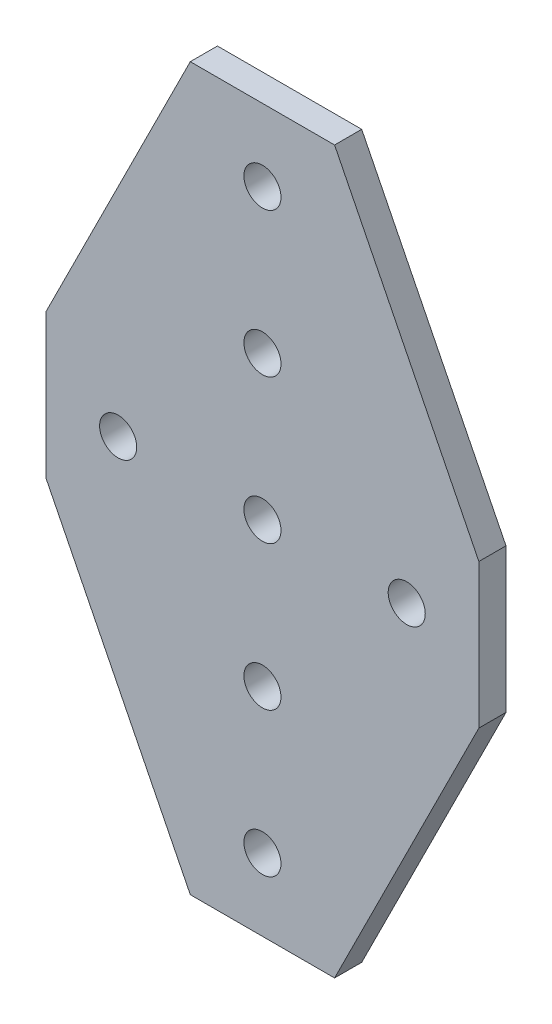
ISO-10303-21;
HEADER;
FILE_DESCRIPTION(('STEP AP214'),'2;1');
FILE_NAME('part.step','',(''),(''),'','','');
FILE_SCHEMA(('AUTOMOTIVE_DESIGN { 1 0 10303 214 1 1 1 1 }'));
ENDSEC;
DATA;
#1=APPLICATION_CONTEXT('core data for automotive mechanical design processes');
#2=APPLICATION_PROTOCOL_DEFINITION('international standard','automotive_design',2000,#1);
#3=PRODUCT_CONTEXT('',#1,'mechanical');
#4=PRODUCT('Part','Part','',(#3));
#5=PRODUCT_RELATED_PRODUCT_CATEGORY('part','',(#4));
#6=PRODUCT_DEFINITION_FORMATION('','',#4);
#7=PRODUCT_DEFINITION_CONTEXT('part definition',#1,'design');
#8=PRODUCT_DEFINITION('design','',#6,#7);
#9=PRODUCT_DEFINITION_SHAPE('','',#8);
#10=(LENGTH_UNIT() NAMED_UNIT(*) SI_UNIT(.MILLI.,.METRE.));
#11=(NAMED_UNIT(*) PLANE_ANGLE_UNIT() SI_UNIT($,.RADIAN.));
#12=(NAMED_UNIT(*) SI_UNIT($,.STERADIAN.) SOLID_ANGLE_UNIT());
#13=UNCERTAINTY_MEASURE_WITH_UNIT(LENGTH_MEASURE(1.E-05),#10,'distance_accuracy_value','');
#14=(GEOMETRIC_REPRESENTATION_CONTEXT(3) GLOBAL_UNCERTAINTY_ASSIGNED_CONTEXT((#13)) GLOBAL_UNIT_ASSIGNED_CONTEXT((#10,
#11,#12)) REPRESENTATION_CONTEXT('',''));
#15=CARTESIAN_POINT('',(0.,0.,0.));
#16=DIRECTION('',(0.,0.,1.));
#17=DIRECTION('',(1.,0.,0.));
#18=AXIS2_PLACEMENT_3D('',#15,#16,#17);
#19=CARTESIAN_POINT('',(-38.1,12.7,-2.3876));
#20=DIRECTION('',(-0.894427190999916,0.447213595499958,0.));
#21=DIRECTION('',(-0.447213595499958,-0.894427190999916,0.));
#22=AXIS2_PLACEMENT_3D('',#19,#20,#21);
#23=PLANE('',#22);
#24=DIRECTION('',(0.,0.,1.));
#25=VECTOR('',#24,1.);
#26=CARTESIAN_POINT('',(-38.1,12.7,-2.3876));
#27=LINE('',#26,#25);
#28=CARTESIAN_POINT('',(-38.1,12.7,-2.3876));
#29=VERTEX_POINT('',#28);
#30=CARTESIAN_POINT('',(-38.1,12.7,2.3876));
#31=VERTEX_POINT('',#30);
#32=EDGE_CURVE('E105',#29,#31,#27,.T.);
#33=ORIENTED_EDGE('',*,*,#32,.T.);
#34=DIRECTION('',(-0.447213595499958,-0.894427190999916,0.));
#35=VECTOR('',#34,1.);
#36=CARTESIAN_POINT('',(-38.1,12.7,2.3876));
#37=LINE('',#36,#35);
#38=CARTESIAN_POINT('',(-12.7,63.5,2.3876));
#39=VERTEX_POINT('',#38);
#40=EDGE_CURVE('E108',#39,#31,#37,.T.);
#41=ORIENTED_EDGE('',*,*,#40,.F.);
#42=DIRECTION('',(0.,0.,1.));
#43=VECTOR('',#42,1.);
#44=CARTESIAN_POINT('',(-12.7,63.5,-2.3876));
#45=LINE('',#44,#43);
#46=CARTESIAN_POINT('',(-12.7,63.5,-2.3876));
#47=VERTEX_POINT('',#46);
#48=EDGE_CURVE('E11',#47,#39,#45,.T.);
#49=ORIENTED_EDGE('',*,*,#48,.F.);
#50=DIRECTION('',(-0.447213595499958,-0.894427190999916,0.));
#51=VECTOR('',#50,1.);
#52=CARTESIAN_POINT('',(-38.1,12.7,-2.3876));
#53=LINE('',#52,#51);
#54=EDGE_CURVE('E109',#47,#29,#53,.T.);
#55=ORIENTED_EDGE('',*,*,#54,.T.);
#56=EDGE_LOOP('',(#33,#41,#49,#55));
#57=FACE_BOUND('',#56,.T.);
#58=ADVANCED_FACE('F43',(#57),#23,.T.);
#59=CARTESIAN_POINT('',(-12.7,63.5,-2.3876));
#60=DIRECTION('',(0.,1.,0.));
#61=DIRECTION('',(-1.,0.,0.));
#62=AXIS2_PLACEMENT_3D('',#59,#60,#61);
#63=PLANE('',#62);
#64=ORIENTED_EDGE('',*,*,#48,.T.);
#65=DIRECTION('',(-1.,0.,0.));
#66=VECTOR('',#65,1.);
#67=CARTESIAN_POINT('',(-12.7,63.5,2.3876));
#68=LINE('',#67,#66);
#69=CARTESIAN_POINT('',(12.7,63.5,2.3876));
#70=VERTEX_POINT('',#69);
#71=EDGE_CURVE('E127',#70,#39,#68,.T.);
#72=ORIENTED_EDGE('',*,*,#71,.F.);
#73=DIRECTION('',(0.,0.,1.));
#74=VECTOR('',#73,1.);
#75=CARTESIAN_POINT('',(12.7,63.5,-2.3876));
#76=LINE('',#75,#74);
#77=CARTESIAN_POINT('',(12.7,63.5,-2.3876));
#78=VERTEX_POINT('',#77);
#79=EDGE_CURVE('E51',#78,#70,#76,.T.);
#80=ORIENTED_EDGE('',*,*,#79,.F.);
#81=DIRECTION('',(-1.,0.,0.));
#82=VECTOR('',#81,1.);
#83=CARTESIAN_POINT('',(-12.7,63.5,-2.3876));
#84=LINE('',#83,#82);
#85=EDGE_CURVE('E114',#78,#47,#84,.T.);
#86=ORIENTED_EDGE('',*,*,#85,.T.);
#87=EDGE_LOOP('',(#64,#72,#80,#86));
#88=FACE_BOUND('',#87,.T.);
#89=ADVANCED_FACE('F208',(#88),#63,.T.);
#90=CARTESIAN_POINT('',(12.7,63.5,-2.3876));
#91=DIRECTION('',(0.894427190999916,0.447213595499958,0.));
#92=DIRECTION('',(-0.447213595499958,0.894427190999916,0.));
#93=AXIS2_PLACEMENT_3D('',#90,#91,#92);
#94=PLANE('',#93);
#95=ORIENTED_EDGE('',*,*,#79,.T.);
#96=DIRECTION('',(-0.447213595499958,0.894427190999916,0.));
#97=VECTOR('',#96,1.);
#98=CARTESIAN_POINT('',(12.7,63.5,2.3876));
#99=LINE('',#98,#97);
#100=CARTESIAN_POINT('',(38.1,12.7,2.3876));
#101=VERTEX_POINT('',#100);
#102=EDGE_CURVE('E145',#101,#70,#99,.T.);
#103=ORIENTED_EDGE('',*,*,#102,.F.);
#104=DIRECTION('',(0.,0.,1.));
#105=VECTOR('',#104,1.);
#106=CARTESIAN_POINT('',(38.1,12.7,-2.3876));
#107=LINE('',#106,#105);
#108=CARTESIAN_POINT('',(38.1,12.7,-2.3876));
#109=VERTEX_POINT('',#108);
#110=EDGE_CURVE('E167',#109,#101,#107,.T.);
#111=ORIENTED_EDGE('',*,*,#110,.F.);
#112=DIRECTION('',(-0.447213595499958,0.894427190999916,0.));
#113=VECTOR('',#112,1.);
#114=CARTESIAN_POINT('',(12.7,63.5,-2.3876));
#115=LINE('',#114,#113);
#116=EDGE_CURVE('E163',#109,#78,#115,.T.);
#117=ORIENTED_EDGE('',*,*,#116,.T.);
#118=EDGE_LOOP('',(#95,#103,#111,#117));
#119=FACE_BOUND('',#118,.T.);
#120=ADVANCED_FACE('F212',(#119),#94,.T.);
#121=CARTESIAN_POINT('',(38.1,12.7,-2.3876));
#122=DIRECTION('',(1.,0.,0.));
#123=DIRECTION('',(0.,1.,0.));
#124=AXIS2_PLACEMENT_3D('',#121,#122,#123);
#125=PLANE('',#124);
#126=ORIENTED_EDGE('',*,*,#110,.T.);
#127=DIRECTION('',(0.,1.,0.));
#128=VECTOR('',#127,1.);
#129=CARTESIAN_POINT('',(38.1,12.7,2.3876));
#130=LINE('',#129,#128);
#131=CARTESIAN_POINT('',(38.1,-12.7,2.3876));
#132=VERTEX_POINT('',#131);
#133=EDGE_CURVE('E142',#132,#101,#130,.T.);
#134=ORIENTED_EDGE('',*,*,#133,.F.);
#135=DIRECTION('',(0.,0.,1.));
#136=VECTOR('',#135,1.);
#137=CARTESIAN_POINT('',(38.1,-12.7,-2.3876));
#138=LINE('',#137,#136);
#139=CARTESIAN_POINT('',(38.1,-12.7,-2.3876));
#140=VERTEX_POINT('',#139);
#141=EDGE_CURVE('E169',#140,#132,#138,.T.);
#142=ORIENTED_EDGE('',*,*,#141,.F.);
#143=DIRECTION('',(0.,1.,0.));
#144=VECTOR('',#143,1.);
#145=CARTESIAN_POINT('',(38.1,12.7,-2.3876));
#146=LINE('',#145,#144);
#147=EDGE_CURVE('E160',#140,#109,#146,.T.);
#148=ORIENTED_EDGE('',*,*,#147,.T.);
#149=EDGE_LOOP('',(#126,#134,#142,#148));
#150=FACE_BOUND('',#149,.T.);
#151=ADVANCED_FACE('F217',(#150),#125,.T.);
#152=CARTESIAN_POINT('',(38.1,-12.7,-2.3876));
#153=DIRECTION('',(0.894427190999916,-0.447213595499958,0.));
#154=DIRECTION('',(0.447213595499958,0.894427190999916,0.));
#155=AXIS2_PLACEMENT_3D('',#152,#153,#154);
#156=PLANE('',#155);
#157=ORIENTED_EDGE('',*,*,#141,.T.);
#158=DIRECTION('',(0.447213595499958,0.894427190999916,0.));
#159=VECTOR('',#158,1.);
#160=CARTESIAN_POINT('',(38.1,-12.7,2.3876));
#161=LINE('',#160,#159);
#162=CARTESIAN_POINT('',(12.7,-63.5,2.3876));
#163=VERTEX_POINT('',#162);
#164=EDGE_CURVE('E139',#163,#132,#161,.T.);
#165=ORIENTED_EDGE('',*,*,#164,.F.);
#166=DIRECTION('',(0.,0.,1.));
#167=VECTOR('',#166,1.);
#168=CARTESIAN_POINT('',(12.7,-63.5,-2.3876));
#169=LINE('',#168,#167);
#170=CARTESIAN_POINT('',(12.7,-63.5,-2.3876));
#171=VERTEX_POINT('',#170);
#172=EDGE_CURVE('E171',#171,#163,#169,.T.);
#173=ORIENTED_EDGE('',*,*,#172,.F.);
#174=DIRECTION('',(0.447213595499958,0.894427190999916,0.));
#175=VECTOR('',#174,1.);
#176=CARTESIAN_POINT('',(38.1,-12.7,-2.3876));
#177=LINE('',#176,#175);
#178=EDGE_CURVE('E157',#171,#140,#177,.T.);
#179=ORIENTED_EDGE('',*,*,#178,.T.);
#180=EDGE_LOOP('',(#157,#165,#173,#179));
#181=FACE_BOUND('',#180,.T.);
#182=ADVANCED_FACE('F226',(#181),#156,.T.);
#183=CARTESIAN_POINT('',(12.7,-63.5,-2.3876));
#184=DIRECTION('',(0.,-1.,0.));
#185=DIRECTION('',(0.,0.,-1.));
#186=AXIS2_PLACEMENT_3D('',#183,#184,#185);
#187=PLANE('',#186);
#188=ORIENTED_EDGE('',*,*,#172,.T.);
#189=DIRECTION('',(1.,0.,0.));
#190=VECTOR('',#189,1.);
#191=CARTESIAN_POINT('',(12.7,-63.5,2.3876));
#192=LINE('',#191,#190);
#193=CARTESIAN_POINT('',(-12.7,-63.5,2.3876));
#194=VERTEX_POINT('',#193);
#195=EDGE_CURVE('E136',#194,#163,#192,.T.);
#196=ORIENTED_EDGE('',*,*,#195,.F.);
#197=DIRECTION('',(0.,0.,1.));
#198=VECTOR('',#197,1.);
#199=CARTESIAN_POINT('',(-12.7,-63.5,-2.3876));
#200=LINE('',#199,#198);
#201=CARTESIAN_POINT('',(-12.7,-63.5,-2.3876));
#202=VERTEX_POINT('',#201);
#203=EDGE_CURVE('E173',#202,#194,#200,.T.);
#204=ORIENTED_EDGE('',*,*,#203,.F.);
#205=DIRECTION('',(1.,0.,0.));
#206=VECTOR('',#205,1.);
#207=CARTESIAN_POINT('',(12.7,-63.5,-2.3876));
#208=LINE('',#207,#206);
#209=EDGE_CURVE('E154',#202,#171,#208,.T.);
#210=ORIENTED_EDGE('',*,*,#209,.T.);
#211=EDGE_LOOP('',(#188,#196,#204,#210));
#212=FACE_BOUND('',#211,.T.);
#213=ADVANCED_FACE('F230',(#212),#187,.T.);
#214=CARTESIAN_POINT('',(-12.7,-63.5,-2.3876));
#215=DIRECTION('',(-0.894427190999916,-0.447213595499958,0.));
#216=DIRECTION('',(0.447213595499958,-0.894427190999916,0.));
#217=AXIS2_PLACEMENT_3D('',#214,#215,#216);
#218=PLANE('',#217);
#219=ORIENTED_EDGE('',*,*,#203,.T.);
#220=DIRECTION('',(0.447213595499958,-0.894427190999916,0.));
#221=VECTOR('',#220,1.);
#222=CARTESIAN_POINT('',(-12.7,-63.5,2.3876));
#223=LINE('',#222,#221);
#224=CARTESIAN_POINT('',(-38.1,-12.7,2.3876));
#225=VERTEX_POINT('',#224);
#226=EDGE_CURVE('E122',#225,#194,#223,.T.);
#227=ORIENTED_EDGE('',*,*,#226,.F.);
#228=DIRECTION('',(0.,0.,1.));
#229=VECTOR('',#228,1.);
#230=CARTESIAN_POINT('',(-38.1,-12.7,-2.3876));
#231=LINE('',#230,#229);
#232=CARTESIAN_POINT('',(-38.1,-12.7,-2.3876));
#233=VERTEX_POINT('',#232);
#234=EDGE_CURVE('E113',#233,#225,#231,.T.);
#235=ORIENTED_EDGE('',*,*,#234,.F.);
#236=DIRECTION('',(0.447213595499958,-0.894427190999916,0.));
#237=VECTOR('',#236,1.);
#238=CARTESIAN_POINT('',(-12.7,-63.5,-2.3876));
#239=LINE('',#238,#237);
#240=EDGE_CURVE('E151',#233,#202,#239,.T.);
#241=ORIENTED_EDGE('',*,*,#240,.T.);
#242=EDGE_LOOP('',(#219,#227,#235,#241));
#243=FACE_BOUND('',#242,.T.);
#244=ADVANCED_FACE('F234',(#243),#218,.T.);
#245=CARTESIAN_POINT('',(-38.1,-12.7,-2.3876));
#246=DIRECTION('',(-1.,0.,0.));
#247=DIRECTION('',(0.,0.,1.));
#248=AXIS2_PLACEMENT_3D('',#245,#246,#247);
#249=PLANE('',#248);
#250=ORIENTED_EDGE('',*,*,#234,.T.);
#251=DIRECTION('',(0.,-1.,0.));
#252=VECTOR('',#251,1.);
#253=CARTESIAN_POINT('',(-38.1,-12.7,2.3876));
#254=LINE('',#253,#252);
#255=EDGE_CURVE('E117',#31,#225,#254,.T.);
#256=ORIENTED_EDGE('',*,*,#255,.F.);
#257=ORIENTED_EDGE('',*,*,#32,.F.);
#258=DIRECTION('',(0.,-1.,0.));
#259=VECTOR('',#258,1.);
#260=CARTESIAN_POINT('',(-38.1,-12.7,-2.3876));
#261=LINE('',#260,#259);
#262=EDGE_CURVE('E149',#29,#233,#261,.T.);
#263=ORIENTED_EDGE('',*,*,#262,.T.);
#264=EDGE_LOOP('',(#250,#256,#257,#263));
#265=FACE_BOUND('',#264,.T.);
#266=ADVANCED_FACE('F118',(#265),#249,.T.);
#267=CARTESIAN_POINT('',(0.,0.,-2.3876));
#268=DIRECTION('',(0.,0.,-1.));
#269=DIRECTION('',(-1.,0.,0.));
#270=AXIS2_PLACEMENT_3D('',#267,#268,#269);
#271=PLANE('',#270);
#272=CARTESIAN_POINT('',(25.4,0.,-2.3876));
#273=DIRECTION('',(0.,0.,1.));
#274=DIRECTION('',(1.,0.,0.));
#275=AXIS2_PLACEMENT_3D('',#272,#273,#274);
#276=CIRCLE('',#275,3.2639);
#277=CARTESIAN_POINT('',(28.6639,0.,-2.3876));
#278=VERTEX_POINT('',#277);
#279=EDGE_CURVE('E252',#278,#278,#276,.T.);
#280=ORIENTED_EDGE('',*,*,#279,.T.);
#281=EDGE_LOOP('',(#280));
#282=FACE_BOUND('',#281,.T.);
#283=CARTESIAN_POINT('',(-25.4,0.,-2.3876));
#284=DIRECTION('',(0.,0.,1.));
#285=DIRECTION('',(-1.,0.,0.));
#286=AXIS2_PLACEMENT_3D('',#283,#284,#285);
#287=CIRCLE('',#286,3.2639);
#288=CARTESIAN_POINT('',(-28.6639,0.,-2.3876));
#289=VERTEX_POINT('',#288);
#290=EDGE_CURVE('E256',#289,#289,#287,.T.);
#291=ORIENTED_EDGE('',*,*,#290,.T.);
#292=EDGE_LOOP('',(#291));
#293=FACE_BOUND('',#292,.T.);
#294=CARTESIAN_POINT('',(0.,50.8,-2.3876));
#295=DIRECTION('',(0.,0.,1.));
#296=DIRECTION('',(1.,0.,0.));
#297=AXIS2_PLACEMENT_3D('',#294,#295,#296);
#298=CIRCLE('',#297,3.2639);
#299=CARTESIAN_POINT('',(3.2639,50.8,-2.3876));
#300=VERTEX_POINT('',#299);
#301=EDGE_CURVE('E180',#300,#300,#298,.T.);
#302=ORIENTED_EDGE('',*,*,#301,.T.);
#303=EDGE_LOOP('',(#302));
#304=FACE_BOUND('',#303,.T.);
#305=CARTESIAN_POINT('',(2.66050878019847E-13,25.4,-2.3876));
#306=DIRECTION('',(0.,0.,1.));
#307=DIRECTION('',(1.,0.,0.));
#308=AXIS2_PLACEMENT_3D('',#305,#306,#307);
#309=CIRCLE('',#308,3.2639);
#310=CARTESIAN_POINT('',(3.26390000000027,25.4,-2.3876));
#311=VERTEX_POINT('',#310);
#312=EDGE_CURVE('E262',#311,#311,#309,.T.);
#313=ORIENTED_EDGE('',*,*,#312,.T.);
#314=EDGE_LOOP('',(#313));
#315=FACE_BOUND('',#314,.T.);
#316=CARTESIAN_POINT('',(5.32101756039693E-13,0.,-2.3876));
#317=DIRECTION('',(0.,0.,1.));
#318=DIRECTION('',(1.,0.,0.));
#319=AXIS2_PLACEMENT_3D('',#316,#317,#318);
#320=CIRCLE('',#319,3.2639);
#321=CARTESIAN_POINT('',(3.26390000000053,0.,-2.3876));
#322=VERTEX_POINT('',#321);
#323=EDGE_CURVE('E266',#322,#322,#320,.T.);
#324=ORIENTED_EDGE('',*,*,#323,.T.);
#325=EDGE_LOOP('',(#324));
#326=FACE_BOUND('',#325,.T.);
#327=CARTESIAN_POINT('',(7.9815263405954E-13,-25.4,-2.3876));
#328=DIRECTION('',(0.,0.,1.));
#329=DIRECTION('',(1.,0.,0.));
#330=AXIS2_PLACEMENT_3D('',#327,#328,#329);
#331=CIRCLE('',#330,3.2639);
#332=CARTESIAN_POINT('',(3.2639000000008,-25.4,-2.3876));
#333=VERTEX_POINT('',#332);
#334=EDGE_CURVE('E270',#333,#333,#331,.T.);
#335=ORIENTED_EDGE('',*,*,#334,.T.);
#336=EDGE_LOOP('',(#335));
#337=FACE_BOUND('',#336,.T.);
#338=CARTESIAN_POINT('',(1.06420351207939E-12,-50.8,-2.3876));
#339=DIRECTION('',(0.,0.,1.));
#340=DIRECTION('',(1.,0.,0.));
#341=AXIS2_PLACEMENT_3D('',#338,#339,#340);
#342=CIRCLE('',#341,3.2639);
#343=CARTESIAN_POINT('',(3.26390000000107,-50.8,-2.3876));
#344=VERTEX_POINT('',#343);
#345=EDGE_CURVE('E132',#344,#344,#342,.T.);
#346=ORIENTED_EDGE('',*,*,#345,.T.);
#347=EDGE_LOOP('',(#346));
#348=FACE_BOUND('',#347,.T.);
#349=ORIENTED_EDGE('',*,*,#54,.F.);
#350=ORIENTED_EDGE('',*,*,#85,.F.);
#351=ORIENTED_EDGE('',*,*,#116,.F.);
#352=ORIENTED_EDGE('',*,*,#147,.F.);
#353=ORIENTED_EDGE('',*,*,#178,.F.);
#354=ORIENTED_EDGE('',*,*,#209,.F.);
#355=ORIENTED_EDGE('',*,*,#240,.F.);
#356=ORIENTED_EDGE('',*,*,#262,.F.);
#357=EDGE_LOOP('',(#349,#350,#351,#352,#353,#354,#355,#356));
#358=FACE_BOUND('',#357,.T.);
#359=ADVANCED_FACE('F221',(#282,#293,#304,#315,#326,#337,#348,#358),#271,.T.);
#360=CARTESIAN_POINT('',(0.,0.,2.3876));
#361=DIRECTION('',(0.,0.,-1.));
#362=DIRECTION('',(-1.,0.,0.));
#363=AXIS2_PLACEMENT_3D('',#360,#361,#362);
#364=PLANE('',#363);
#365=CARTESIAN_POINT('',(25.4,0.,2.3876));
#366=DIRECTION('',(0.,0.,1.));
#367=DIRECTION('',(1.,0.,0.));
#368=AXIS2_PLACEMENT_3D('',#365,#366,#367);
#369=CIRCLE('',#368,3.2639);
#370=CARTESIAN_POINT('',(28.6639,0.,2.3876));
#371=VERTEX_POINT('',#370);
#372=EDGE_CURVE('E285',#371,#371,#369,.T.);
#373=ORIENTED_EDGE('',*,*,#372,.F.);
#374=EDGE_LOOP('',(#373));
#375=FACE_BOUND('',#374,.T.);
#376=CARTESIAN_POINT('',(-25.4,0.,2.3876));
#377=DIRECTION('',(0.,0.,1.));
#378=DIRECTION('',(-1.,0.,0.));
#379=AXIS2_PLACEMENT_3D('',#376,#377,#378);
#380=CIRCLE('',#379,3.2639);
#381=CARTESIAN_POINT('',(-28.6639,0.,2.3876));
#382=VERTEX_POINT('',#381);
#383=EDGE_CURVE('E291',#382,#382,#380,.T.);
#384=ORIENTED_EDGE('',*,*,#383,.F.);
#385=EDGE_LOOP('',(#384));
#386=FACE_BOUND('',#385,.T.);
#387=CARTESIAN_POINT('',(0.,50.8,2.3876));
#388=DIRECTION('',(0.,0.,-1.));
#389=DIRECTION('',(-1.,0.,0.));
#390=AXIS2_PLACEMENT_3D('',#387,#388,#389);
#391=CIRCLE('',#390,3.2639);
#392=CARTESIAN_POINT('',(-3.2639,50.8,2.3876));
#393=VERTEX_POINT('',#392);
#394=EDGE_CURVE('E46',#393,#393,#391,.T.);
#395=ORIENTED_EDGE('',*,*,#394,.T.);
#396=EDGE_LOOP('',(#395));
#397=FACE_BOUND('',#396,.T.);
#398=CARTESIAN_POINT('',(2.66050878019847E-13,25.4,2.3876));
#399=DIRECTION('',(0.,0.,-1.));
#400=DIRECTION('',(-1.,0.,0.));
#401=AXIS2_PLACEMENT_3D('',#398,#399,#400);
#402=CIRCLE('',#401,3.2639);
#403=CARTESIAN_POINT('',(-3.26389999999974,25.4,2.3876));
#404=VERTEX_POINT('',#403);
#405=EDGE_CURVE('E130',#404,#404,#402,.T.);
#406=ORIENTED_EDGE('',*,*,#405,.T.);
#407=EDGE_LOOP('',(#406));
#408=FACE_BOUND('',#407,.T.);
#409=CARTESIAN_POINT('',(5.32101756039693E-13,0.,2.3876));
#410=DIRECTION('',(0.,0.,-1.));
#411=DIRECTION('',(-1.,0.,0.));
#412=AXIS2_PLACEMENT_3D('',#409,#410,#411);
#413=CIRCLE('',#412,3.2639);
#414=CARTESIAN_POINT('',(-3.26389999999947,0.,2.3876));
#415=VERTEX_POINT('',#414);
#416=EDGE_CURVE('E183',#415,#415,#413,.T.);
#417=ORIENTED_EDGE('',*,*,#416,.T.);
#418=EDGE_LOOP('',(#417));
#419=FACE_BOUND('',#418,.T.);
#420=CARTESIAN_POINT('',(7.9815263405954E-13,-25.4,2.3876));
#421=DIRECTION('',(0.,0.,-1.));
#422=DIRECTION('',(-1.,0.,0.));
#423=AXIS2_PLACEMENT_3D('',#420,#421,#422);
#424=CIRCLE('',#423,3.2639);
#425=CARTESIAN_POINT('',(-3.2638999999992,-25.4,2.3876));
#426=VERTEX_POINT('',#425);
#427=EDGE_CURVE('E179',#426,#426,#424,.T.);
#428=ORIENTED_EDGE('',*,*,#427,.T.);
#429=EDGE_LOOP('',(#428));
#430=FACE_BOUND('',#429,.T.);
#431=CARTESIAN_POINT('',(1.06420351207939E-12,-50.8,2.3876));
#432=DIRECTION('',(0.,0.,-1.));
#433=DIRECTION('',(-1.,0.,0.));
#434=AXIS2_PLACEMENT_3D('',#431,#432,#433);
#435=CIRCLE('',#434,3.2639);
#436=CARTESIAN_POINT('',(-3.26389999999894,-50.8,2.3876));
#437=VERTEX_POINT('',#436);
#438=EDGE_CURVE('E176',#437,#437,#435,.T.);
#439=ORIENTED_EDGE('',*,*,#438,.T.);
#440=EDGE_LOOP('',(#439));
#441=FACE_BOUND('',#440,.T.);
#442=ORIENTED_EDGE('',*,*,#40,.T.);
#443=ORIENTED_EDGE('',*,*,#255,.T.);
#444=ORIENTED_EDGE('',*,*,#226,.T.);
#445=ORIENTED_EDGE('',*,*,#195,.T.);
#446=ORIENTED_EDGE('',*,*,#164,.T.);
#447=ORIENTED_EDGE('',*,*,#133,.T.);
#448=ORIENTED_EDGE('',*,*,#102,.T.);
#449=ORIENTED_EDGE('',*,*,#71,.T.);
#450=EDGE_LOOP('',(#442,#443,#444,#445,#446,#447,#448,#449));
#451=FACE_BOUND('',#450,.T.);
#452=ADVANCED_FACE('F125',(#375,#386,#397,#408,#419,#430,#441,#451),#364,.F.);
#453=CARTESIAN_POINT('',(1.06420351207939E-12,-50.8,-2.3876));
#454=DIRECTION('',(0.,0.,1.));
#455=DIRECTION('',(1.,0.,0.));
#456=AXIS2_PLACEMENT_3D('',#453,#454,#455);
#457=CYLINDRICAL_SURFACE('',#456,3.2639);
#458=ORIENTED_EDGE('',*,*,#345,.F.);
#459=EDGE_LOOP('',(#458));
#460=FACE_BOUND('',#459,.T.);
#461=ORIENTED_EDGE('',*,*,#438,.F.);
#462=EDGE_LOOP('',(#461));
#463=FACE_BOUND('',#462,.T.);
#464=ADVANCED_FACE('F247',(#460,#463),#457,.F.);
#465=CARTESIAN_POINT('',(7.9815263405954E-13,-25.4,-2.3876));
#466=DIRECTION('',(0.,0.,1.));
#467=DIRECTION('',(1.,0.,0.));
#468=AXIS2_PLACEMENT_3D('',#465,#466,#467);
#469=CYLINDRICAL_SURFACE('',#468,3.2639);
#470=ORIENTED_EDGE('',*,*,#334,.F.);
#471=EDGE_LOOP('',(#470));
#472=FACE_BOUND('',#471,.T.);
#473=ORIENTED_EDGE('',*,*,#427,.F.);
#474=EDGE_LOOP('',(#473));
#475=FACE_BOUND('',#474,.T.);
#476=ADVANCED_FACE('F203',(#472,#475),#469,.F.);
#477=CARTESIAN_POINT('',(5.32101756039693E-13,0.,-2.3876));
#478=DIRECTION('',(0.,0.,1.));
#479=DIRECTION('',(1.,0.,0.));
#480=AXIS2_PLACEMENT_3D('',#477,#478,#479);
#481=CYLINDRICAL_SURFACE('',#480,3.2639);
#482=ORIENTED_EDGE('',*,*,#323,.F.);
#483=EDGE_LOOP('',(#482));
#484=FACE_BOUND('',#483,.T.);
#485=ORIENTED_EDGE('',*,*,#416,.F.);
#486=EDGE_LOOP('',(#485));
#487=FACE_BOUND('',#486,.T.);
#488=ADVANCED_FACE('F193',(#484,#487),#481,.F.);
#489=CARTESIAN_POINT('',(2.66050878019847E-13,25.4,-2.3876));
#490=DIRECTION('',(0.,0.,1.));
#491=DIRECTION('',(1.,0.,0.));
#492=AXIS2_PLACEMENT_3D('',#489,#490,#491);
#493=CYLINDRICAL_SURFACE('',#492,3.2639);
#494=ORIENTED_EDGE('',*,*,#312,.F.);
#495=EDGE_LOOP('',(#494));
#496=FACE_BOUND('',#495,.T.);
#497=ORIENTED_EDGE('',*,*,#405,.F.);
#498=EDGE_LOOP('',(#497));
#499=FACE_BOUND('',#498,.T.);
#500=ADVANCED_FACE('F190',(#496,#499),#493,.F.);
#501=CARTESIAN_POINT('',(0.,50.8,-2.3876));
#502=DIRECTION('',(0.,0.,1.));
#503=DIRECTION('',(1.,0.,0.));
#504=AXIS2_PLACEMENT_3D('',#501,#502,#503);
#505=CYLINDRICAL_SURFACE('',#504,3.2639);
#506=ORIENTED_EDGE('',*,*,#301,.F.);
#507=EDGE_LOOP('',(#506));
#508=FACE_BOUND('',#507,.T.);
#509=ORIENTED_EDGE('',*,*,#394,.F.);
#510=EDGE_LOOP('',(#509));
#511=FACE_BOUND('',#510,.T.);
#512=ADVANCED_FACE('F192',(#508,#511),#505,.F.);
#513=CARTESIAN_POINT('',(-25.4,0.,-2.3876));
#514=DIRECTION('',(0.,0.,1.));
#515=DIRECTION('',(1.,0.,0.));
#516=AXIS2_PLACEMENT_3D('',#513,#514,#515);
#517=CYLINDRICAL_SURFACE('',#516,3.2639);
#518=ORIENTED_EDGE('',*,*,#290,.F.);
#519=EDGE_LOOP('',(#518));
#520=FACE_BOUND('',#519,.T.);
#521=ORIENTED_EDGE('',*,*,#383,.T.);
#522=EDGE_LOOP('',(#521));
#523=FACE_BOUND('',#522,.T.);
#524=ADVANCED_FACE('F200',(#520,#523),#517,.F.);
#525=CARTESIAN_POINT('',(25.4,0.,-2.3876));
#526=DIRECTION('',(0.,0.,1.));
#527=DIRECTION('',(1.,0.,0.));
#528=AXIS2_PLACEMENT_3D('',#525,#526,#527);
#529=CYLINDRICAL_SURFACE('',#528,3.2639);
#530=ORIENTED_EDGE('',*,*,#279,.F.);
#531=EDGE_LOOP('',(#530));
#532=FACE_BOUND('',#531,.T.);
#533=ORIENTED_EDGE('',*,*,#372,.T.);
#534=EDGE_LOOP('',(#533));
#535=FACE_BOUND('',#534,.T.);
#536=ADVANCED_FACE('F303',(#532,#535),#529,.F.);
#537=CLOSED_SHELL('',(#58,#89,#120,#151,#182,#213,#244,#266,#359,#452,#464,#476,#488,#500,#512,
#524,#536));
#538=MANIFOLD_SOLID_BREP('B2',#537);
#539=ADVANCED_BREP_SHAPE_REPRESENTATION('',(#18,#538),#14);
#540=SHAPE_DEFINITION_REPRESENTATION(#9,#539);
ENDSEC;
END-ISO-10303-21;
